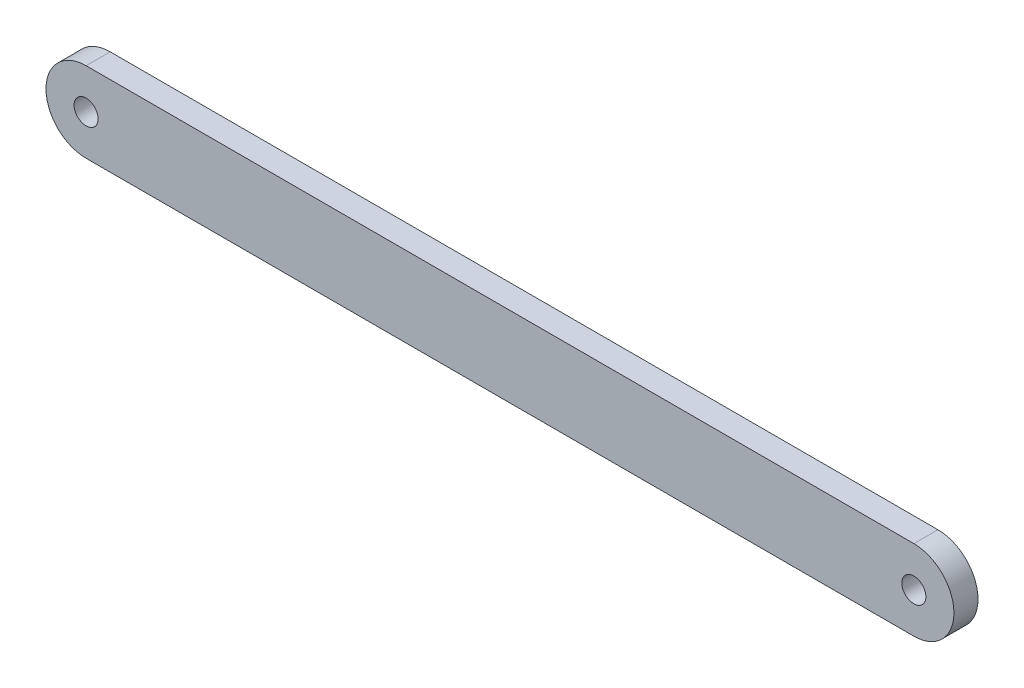
ISO-10303-21;
HEADER;
FILE_DESCRIPTION(('STEP AP214'),'2;1');
FILE_NAME('part.step','',(''),(''),'','','');
FILE_SCHEMA(('AUTOMOTIVE_DESIGN { 1 0 10303 214 1 1 1 1 }'));
ENDSEC;
DATA;
#1=APPLICATION_CONTEXT('core data for automotive mechanical design processes');
#2=APPLICATION_PROTOCOL_DEFINITION('international standard','automotive_design',2000,#1);
#3=PRODUCT_CONTEXT('',#1,'mechanical');
#4=PRODUCT('Part','Part','',(#3));
#5=PRODUCT_RELATED_PRODUCT_CATEGORY('part','',(#4));
#6=PRODUCT_DEFINITION_FORMATION('','',#4);
#7=PRODUCT_DEFINITION_CONTEXT('part definition',#1,'design');
#8=PRODUCT_DEFINITION('design','',#6,#7);
#9=PRODUCT_DEFINITION_SHAPE('','',#8);
#10=(LENGTH_UNIT() NAMED_UNIT(*) SI_UNIT(.MILLI.,.METRE.));
#11=(NAMED_UNIT(*) PLANE_ANGLE_UNIT() SI_UNIT($,.RADIAN.));
#12=(NAMED_UNIT(*) SI_UNIT($,.STERADIAN.) SOLID_ANGLE_UNIT());
#13=UNCERTAINTY_MEASURE_WITH_UNIT(LENGTH_MEASURE(1.E-05),#10,'distance_accuracy_value','');
#14=(GEOMETRIC_REPRESENTATION_CONTEXT(3) GLOBAL_UNCERTAINTY_ASSIGNED_CONTEXT((#13)) GLOBAL_UNIT_ASSIGNED_CONTEXT((#10,
#11,#12)) REPRESENTATION_CONTEXT('',''));
#15=CARTESIAN_POINT('',(0.,0.,0.));
#16=DIRECTION('',(0.,0.,1.));
#17=DIRECTION('',(1.,0.,0.));
#18=AXIS2_PLACEMENT_3D('',#15,#16,#17);
#19=CARTESIAN_POINT('',(-25.805,0.,0.75));
#20=DIRECTION('',(0.,0.,1.));
#21=DIRECTION('',(1.,0.,0.));
#22=AXIS2_PLACEMENT_3D('',#19,#20,#21);
#23=PLANE('',#22);
#24=CARTESIAN_POINT('',(25.805,0.,0.75));
#25=DIRECTION('',(0.,0.,1.));
#26=DIRECTION('',(1.,0.,0.));
#27=AXIS2_PLACEMENT_3D('',#24,#25,#26);
#28=CIRCLE('',#27,0.750000000000002);
#29=CARTESIAN_POINT('',(26.555,0.,0.75));
#30=VERTEX_POINT('',#29);
#31=EDGE_CURVE('E100',#30,#30,#28,.T.);
#32=ORIENTED_EDGE('',*,*,#31,.F.);
#33=EDGE_LOOP('',(#32));
#34=FACE_BOUND('',#33,.T.);
#35=CARTESIAN_POINT('',(-25.805,0.,0.75));
#36=DIRECTION('',(0.,0.,1.));
#37=DIRECTION('',(1.,0.,0.));
#38=AXIS2_PLACEMENT_3D('',#35,#36,#37);
#39=CIRCLE('',#38,2.50000000000001);
#40=CARTESIAN_POINT('',(-25.805,2.50000000000001,0.75));
#41=VERTEX_POINT('',#40);
#42=CARTESIAN_POINT('',(-25.805,-2.50000000000001,0.75));
#43=VERTEX_POINT('',#42);
#44=EDGE_CURVE('E85',#41,#43,#39,.T.);
#45=ORIENTED_EDGE('',*,*,#44,.T.);
#46=DIRECTION('',(1.,0.,0.));
#47=VECTOR('',#46,1.);
#48=CARTESIAN_POINT('',(-25.805,-2.50000000000001,0.75));
#49=LINE('',#48,#47);
#50=CARTESIAN_POINT('',(25.805,-2.5,0.75));
#51=VERTEX_POINT('',#50);
#52=EDGE_CURVE('E80',#43,#51,#49,.T.);
#53=ORIENTED_EDGE('',*,*,#52,.T.);
#54=CARTESIAN_POINT('',(25.805,0.,0.75));
#55=DIRECTION('',(0.,0.,1.));
#56=DIRECTION('',(1.,0.,0.));
#57=AXIS2_PLACEMENT_3D('',#54,#55,#56);
#58=CIRCLE('',#57,2.50000000000001);
#59=CARTESIAN_POINT('',(25.805,2.50000000000002,0.75));
#60=VERTEX_POINT('',#59);
#61=EDGE_CURVE('E83',#51,#60,#58,.T.);
#62=ORIENTED_EDGE('',*,*,#61,.T.);
#63=DIRECTION('',(-1.,0.,0.));
#64=VECTOR('',#63,1.);
#65=CARTESIAN_POINT('',(-25.805,2.50000000000001,0.75));
#66=LINE('',#65,#64);
#67=EDGE_CURVE('E50',#60,#41,#66,.T.);
#68=ORIENTED_EDGE('',*,*,#67,.T.);
#69=EDGE_LOOP('',(#45,#53,#62,#68));
#70=FACE_BOUND('',#69,.T.);
#71=CARTESIAN_POINT('',(-25.805,0.,0.75));
#72=DIRECTION('',(0.,0.,1.));
#73=DIRECTION('',(1.,0.,0.));
#74=AXIS2_PLACEMENT_3D('',#71,#72,#73);
#75=CIRCLE('',#74,0.750000000000002);
#76=CARTESIAN_POINT('',(-25.055,0.,0.75));
#77=VERTEX_POINT('',#76);
#78=EDGE_CURVE('E115',#77,#77,#75,.T.);
#79=ORIENTED_EDGE('',*,*,#78,.F.);
#80=EDGE_LOOP('',(#79));
#81=FACE_BOUND('',#80,.T.);
#82=ADVANCED_FACE('F33',(#34,#70,#81),#23,.T.);
#83=CARTESIAN_POINT('',(-25.805,0.,-0.75));
#84=DIRECTION('',(0.,0.,1.));
#85=DIRECTION('',(1.,0.,0.));
#86=AXIS2_PLACEMENT_3D('',#83,#84,#85);
#87=PLANE('',#86);
#88=CARTESIAN_POINT('',(-25.805,0.,-0.75));
#89=DIRECTION('',(0.,0.,1.));
#90=DIRECTION('',(1.,0.,0.));
#91=AXIS2_PLACEMENT_3D('',#88,#89,#90);
#92=CIRCLE('',#91,2.50000000000001);
#93=CARTESIAN_POINT('',(-25.805,2.50000000000001,-0.75));
#94=VERTEX_POINT('',#93);
#95=CARTESIAN_POINT('',(-25.805,-2.50000000000001,-0.75));
#96=VERTEX_POINT('',#95);
#97=EDGE_CURVE('E97',#94,#96,#92,.T.);
#98=ORIENTED_EDGE('',*,*,#97,.F.);
#99=DIRECTION('',(-1.,0.,0.));
#100=VECTOR('',#99,1.);
#101=CARTESIAN_POINT('',(-25.805,2.50000000000001,-0.75));
#102=LINE('',#101,#100);
#103=CARTESIAN_POINT('',(25.805,2.50000000000002,-0.75));
#104=VERTEX_POINT('',#103);
#105=EDGE_CURVE('E73',#104,#94,#102,.T.);
#106=ORIENTED_EDGE('',*,*,#105,.F.);
#107=CARTESIAN_POINT('',(25.805,0.,-0.75));
#108=DIRECTION('',(0.,0.,1.));
#109=DIRECTION('',(1.,0.,0.));
#110=AXIS2_PLACEMENT_3D('',#107,#108,#109);
#111=CIRCLE('',#110,2.50000000000001);
#112=CARTESIAN_POINT('',(25.805,-2.5,-0.75));
#113=VERTEX_POINT('',#112);
#114=EDGE_CURVE('E67',#113,#104,#111,.T.);
#115=ORIENTED_EDGE('',*,*,#114,.F.);
#116=DIRECTION('',(1.,0.,0.));
#117=VECTOR('',#116,1.);
#118=CARTESIAN_POINT('',(-25.805,-2.50000000000001,-0.75));
#119=LINE('',#118,#117);
#120=EDGE_CURVE('E89',#96,#113,#119,.T.);
#121=ORIENTED_EDGE('',*,*,#120,.F.);
#122=EDGE_LOOP('',(#98,#106,#115,#121));
#123=FACE_BOUND('',#122,.T.);
#124=CARTESIAN_POINT('',(25.805,0.,-0.75));
#125=DIRECTION('',(0.,0.,1.));
#126=DIRECTION('',(1.,0.,0.));
#127=AXIS2_PLACEMENT_3D('',#124,#125,#126);
#128=CIRCLE('',#127,0.750000000000002);
#129=CARTESIAN_POINT('',(26.555,0.,-0.75));
#130=VERTEX_POINT('',#129);
#131=EDGE_CURVE('E112',#130,#130,#128,.T.);
#132=ORIENTED_EDGE('',*,*,#131,.T.);
#133=EDGE_LOOP('',(#132));
#134=FACE_BOUND('',#133,.T.);
#135=CARTESIAN_POINT('',(-25.805,0.,-0.75));
#136=DIRECTION('',(0.,0.,1.));
#137=DIRECTION('',(1.,0.,0.));
#138=AXIS2_PLACEMENT_3D('',#135,#136,#137);
#139=CIRCLE('',#138,0.750000000000002);
#140=CARTESIAN_POINT('',(-25.055,0.,-0.75));
#141=VERTEX_POINT('',#140);
#142=EDGE_CURVE('E118',#141,#141,#139,.T.);
#143=ORIENTED_EDGE('',*,*,#142,.T.);
#144=EDGE_LOOP('',(#143));
#145=FACE_BOUND('',#144,.T.);
#146=ADVANCED_FACE('F108',(#123,#134,#145),#87,.F.);
#147=CARTESIAN_POINT('',(-25.805,0.,0.75));
#148=DIRECTION('',(0.,0.,-1.));
#149=DIRECTION('',(-1.,0.,0.));
#150=AXIS2_PLACEMENT_3D('',#147,#148,#149);
#151=CYLINDRICAL_SURFACE('',#150,2.50000000000001);
#152=ORIENTED_EDGE('',*,*,#97,.T.);
#153=DIRECTION('',(0.,0.,-1.));
#154=VECTOR('',#153,1.);
#155=CARTESIAN_POINT('',(-25.805,-2.50000000000001,0.75));
#156=LINE('',#155,#154);
#157=EDGE_CURVE('E11',#43,#96,#156,.T.);
#158=ORIENTED_EDGE('',*,*,#157,.F.);
#159=ORIENTED_EDGE('',*,*,#44,.F.);
#160=DIRECTION('',(0.,0.,-1.));
#161=VECTOR('',#160,1.);
#162=CARTESIAN_POINT('',(-25.805,2.50000000000001,0.75));
#163=LINE('',#162,#161);
#164=EDGE_CURVE('E93',#41,#94,#163,.T.);
#165=ORIENTED_EDGE('',*,*,#164,.T.);
#166=EDGE_LOOP('',(#152,#158,#159,#165));
#167=FACE_BOUND('',#166,.T.);
#168=ADVANCED_FACE('F35',(#167),#151,.T.);
#169=CARTESIAN_POINT('',(-25.805,-2.50000000000001,0.75));
#170=DIRECTION('',(0.,1.,0.));
#171=DIRECTION('',(-1.,0.,0.));
#172=AXIS2_PLACEMENT_3D('',#169,#170,#171);
#173=PLANE('',#172);
#174=ORIENTED_EDGE('',*,*,#120,.T.);
#175=DIRECTION('',(0.,0.,-1.));
#176=VECTOR('',#175,1.);
#177=CARTESIAN_POINT('',(25.805,-2.5,0.75));
#178=LINE('',#177,#176);
#179=EDGE_CURVE('E42',#51,#113,#178,.T.);
#180=ORIENTED_EDGE('',*,*,#179,.F.);
#181=ORIENTED_EDGE('',*,*,#52,.F.);
#182=ORIENTED_EDGE('',*,*,#157,.T.);
#183=EDGE_LOOP('',(#174,#180,#181,#182));
#184=FACE_BOUND('',#183,.T.);
#185=ADVANCED_FACE('F88',(#184),#173,.F.);
#186=CARTESIAN_POINT('',(25.805,0.,0.75));
#187=DIRECTION('',(0.,0.,-1.));
#188=DIRECTION('',(-1.,0.,0.));
#189=AXIS2_PLACEMENT_3D('',#186,#187,#188);
#190=CYLINDRICAL_SURFACE('',#189,2.50000000000001);
#191=ORIENTED_EDGE('',*,*,#114,.T.);
#192=DIRECTION('',(0.,0.,-1.));
#193=VECTOR('',#192,1.);
#194=CARTESIAN_POINT('',(25.805,2.50000000000002,0.75));
#195=LINE('',#194,#193);
#196=EDGE_CURVE('E90',#60,#104,#195,.T.);
#197=ORIENTED_EDGE('',*,*,#196,.F.);
#198=ORIENTED_EDGE('',*,*,#61,.F.);
#199=ORIENTED_EDGE('',*,*,#179,.T.);
#200=EDGE_LOOP('',(#191,#197,#198,#199));
#201=FACE_BOUND('',#200,.T.);
#202=ADVANCED_FACE('F91',(#201),#190,.T.);
#203=CARTESIAN_POINT('',(-25.805,2.50000000000001,0.75));
#204=DIRECTION('',(0.,-1.,0.));
#205=DIRECTION('',(1.,0.,0.));
#206=AXIS2_PLACEMENT_3D('',#203,#204,#205);
#207=PLANE('',#206);
#208=ORIENTED_EDGE('',*,*,#105,.T.);
#209=ORIENTED_EDGE('',*,*,#164,.F.);
#210=ORIENTED_EDGE('',*,*,#67,.F.);
#211=ORIENTED_EDGE('',*,*,#196,.T.);
#212=EDGE_LOOP('',(#208,#209,#210,#211));
#213=FACE_BOUND('',#212,.T.);
#214=ADVANCED_FACE('F105',(#213),#207,.F.);
#215=CARTESIAN_POINT('',(25.805,0.,0.75));
#216=DIRECTION('',(0.,0.,-1.));
#217=DIRECTION('',(-1.,0.,0.));
#218=AXIS2_PLACEMENT_3D('',#215,#216,#217);
#219=CYLINDRICAL_SURFACE('',#218,0.750000000000002);
#220=ORIENTED_EDGE('',*,*,#31,.T.);
#221=EDGE_LOOP('',(#220));
#222=FACE_BOUND('',#221,.T.);
#223=ORIENTED_EDGE('',*,*,#131,.F.);
#224=EDGE_LOOP('',(#223));
#225=FACE_BOUND('',#224,.T.);
#226=ADVANCED_FACE('F135',(#222,#225),#219,.F.);
#227=CARTESIAN_POINT('',(-25.805,0.,0.75));
#228=DIRECTION('',(0.,0.,-1.));
#229=DIRECTION('',(-1.,0.,0.));
#230=AXIS2_PLACEMENT_3D('',#227,#228,#229);
#231=CYLINDRICAL_SURFACE('',#230,0.750000000000002);
#232=ORIENTED_EDGE('',*,*,#78,.T.);
#233=EDGE_LOOP('',(#232));
#234=FACE_BOUND('',#233,.T.);
#235=ORIENTED_EDGE('',*,*,#142,.F.);
#236=EDGE_LOOP('',(#235));
#237=FACE_BOUND('',#236,.T.);
#238=ADVANCED_FACE('F124',(#234,#237),#231,.F.);
#239=CLOSED_SHELL('',(#82,#146,#168,#185,#202,#214,#226,#238));
#240=MANIFOLD_SOLID_BREP('B2',#239);
#241=ADVANCED_BREP_SHAPE_REPRESENTATION('',(#18,#240),#14);
#242=SHAPE_DEFINITION_REPRESENTATION(#9,#241);
ENDSEC;
END-ISO-10303-21;
